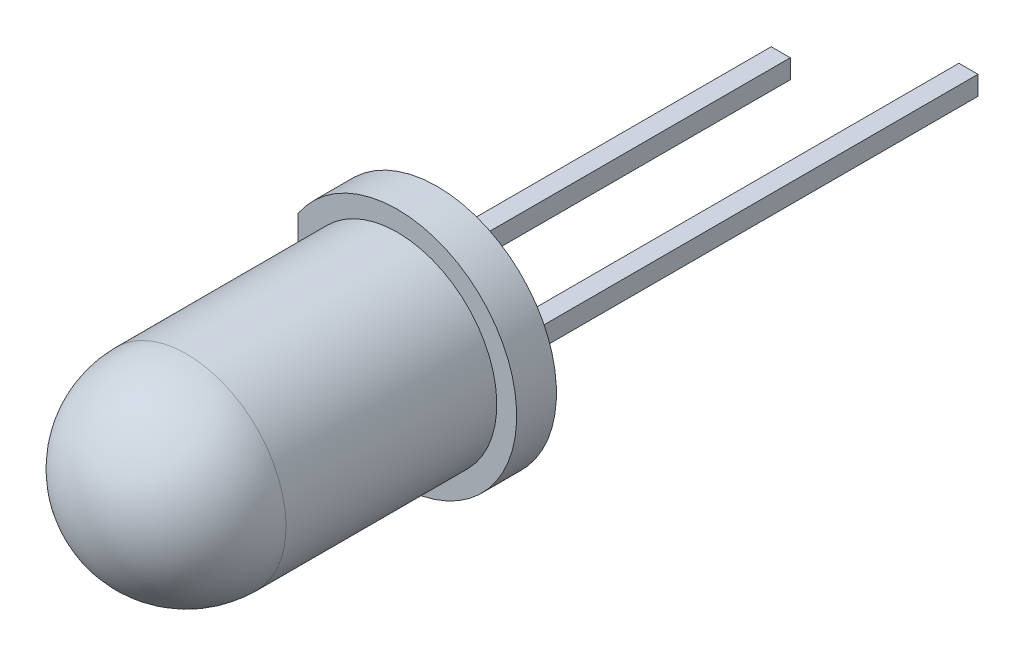
ISO-10303-21;
HEADER;
FILE_DESCRIPTION(('STEP AP214'),'2;1');
FILE_NAME('part.step','',(''),(''),'','','');
FILE_SCHEMA(('AUTOMOTIVE_DESIGN { 1 0 10303 214 1 1 1 1 }'));
ENDSEC;
DATA;
#1=APPLICATION_CONTEXT('core data for automotive mechanical design processes');
#2=APPLICATION_PROTOCOL_DEFINITION('international standard','automotive_design',2000,#1);
#3=PRODUCT_CONTEXT('',#1,'mechanical');
#4=PRODUCT('Part','Part','',(#3));
#5=PRODUCT_RELATED_PRODUCT_CATEGORY('part','',(#4));
#6=PRODUCT_DEFINITION_FORMATION('','',#4);
#7=PRODUCT_DEFINITION_CONTEXT('part definition',#1,'design');
#8=PRODUCT_DEFINITION('design','',#6,#7);
#9=PRODUCT_DEFINITION_SHAPE('','',#8);
#10=(LENGTH_UNIT() NAMED_UNIT(*) SI_UNIT(.MILLI.,.METRE.));
#11=(NAMED_UNIT(*) PLANE_ANGLE_UNIT() SI_UNIT($,.RADIAN.));
#12=(NAMED_UNIT(*) SI_UNIT($,.STERADIAN.) SOLID_ANGLE_UNIT());
#13=UNCERTAINTY_MEASURE_WITH_UNIT(LENGTH_MEASURE(1.E-05),#10,'distance_accuracy_value','');
#14=(GEOMETRIC_REPRESENTATION_CONTEXT(3) GLOBAL_UNCERTAINTY_ASSIGNED_CONTEXT((#13)) GLOBAL_UNIT_ASSIGNED_CONTEXT((#10,
#11,#12)) REPRESENTATION_CONTEXT('',''));
#15=CARTESIAN_POINT('',(0.,0.,0.));
#16=DIRECTION('',(0.,0.,1.));
#17=DIRECTION('',(1.,0.,0.));
#18=AXIS2_PLACEMENT_3D('',#15,#16,#17);
#19=CARTESIAN_POINT('',(-0.0499999999999997,0.,4.26666666666667));
#20=DIRECTION('',(0.,0.,1.));
#21=DIRECTION('',(-1.,0.,0.));
#22=AXIS2_PLACEMENT_3D('',#19,#20,#21);
#23=SPHERICAL_SURFACE('',#22,0.566666666666667);
#24=CARTESIAN_POINT('',(-0.0499999999999997,-0.24,4.26666666666667));
#25=DIRECTION('',(0.,1.,0.));
#26=DIRECTION('',(0.,0.,1.));
#27=AXIS2_PLACEMENT_3D('',#24,#25,#26);
#28=CIRCLE('',#27,0.513333333333333);
#29=CARTESIAN_POINT('',(-0.488634243989226,-0.24,4.));
#30=VERTEX_POINT('',#29);
#31=CARTESIAN_POINT('',(0.388634243989226,-0.24,4.));
#32=VERTEX_POINT('',#31);
#33=EDGE_CURVE('E162',#30,#32,#28,.F.);
#34=ORIENTED_EDGE('',*,*,#33,.T.);
#35=CARTESIAN_POINT('',(-0.0499999999999997,0.,4.));
#36=DIRECTION('',(0.,0.,1.));
#37=DIRECTION('',(1.,0.,0.));
#38=AXIS2_PLACEMENT_3D('',#35,#36,#37);
#39=CIRCLE('',#38,0.5);
#40=EDGE_CURVE('E57',#30,#32,#39,.T.);
#41=ORIENTED_EDGE('',*,*,#40,.F.);
#42=EDGE_LOOP('',(#34,#41));
#43=FACE_BOUND('',#42,.T.);
#44=ADVANCED_FACE('F49',(#43),#23,.T.);
#45=CARTESIAN_POINT('',(0.388634243989226,0.24,4.));
#46=VERTEX_POINT('',#45);
#47=CARTESIAN_POINT('',(-0.488634243989226,0.24,4.));
#48=VERTEX_POINT('',#47);
#49=EDGE_CURVE('E12',#46,#48,#39,.T.);
#50=ORIENTED_EDGE('',*,*,#49,.F.);
#51=CARTESIAN_POINT('',(-0.0499999999999997,0.24,4.26666666666667));
#52=DIRECTION('',(0.,1.,0.));
#53=DIRECTION('',(0.,0.,1.));
#54=AXIS2_PLACEMENT_3D('',#51,#52,#53);
#55=CIRCLE('',#54,0.513333333333333);
#56=EDGE_CURVE('E184',#48,#46,#55,.F.);
#57=ORIENTED_EDGE('',*,*,#56,.F.);
#58=EDGE_LOOP('',(#50,#57));
#59=FACE_BOUND('',#58,.T.);
#60=ADVANCED_FACE('F51',(#59),#23,.T.);
#61=CARTESIAN_POINT('',(-0.55,0.,4.));
#62=DIRECTION('',(0.,0.,-1.));
#63=DIRECTION('',(-1.,0.,0.));
#64=AXIS2_PLACEMENT_3D('',#61,#62,#63);
#65=PLANE('',#64);
#66=CARTESIAN_POINT('',(-0.0499999999999997,0.,4.));
#67=DIRECTION('',(0.,0.,1.));
#68=DIRECTION('',(1.,0.,0.));
#69=AXIS2_PLACEMENT_3D('',#66,#67,#68);
#70=CIRCLE('',#69,0.2);
#71=CARTESIAN_POINT('',(0.15,0.,4.));
#72=VERTEX_POINT('',#71);
#73=EDGE_CURVE('E257',#72,#72,#70,.T.);
#74=ORIENTED_EDGE('',*,*,#73,.F.);
#75=EDGE_LOOP('',(#74));
#76=FACE_BOUND('',#75,.T.);
#77=ORIENTED_EDGE('',*,*,#49,.T.);
#78=DIRECTION('',(1.,0.,0.));
#79=VECTOR('',#78,1.);
#80=CARTESIAN_POINT('',(-1.3,0.24,4.));
#81=LINE('',#80,#79);
#82=CARTESIAN_POINT('',(-1.3,0.24,4.));
#83=VERTEX_POINT('',#82);
#84=EDGE_CURVE('E103',#83,#48,#81,.T.);
#85=ORIENTED_EDGE('',*,*,#84,.F.);
#86=DIRECTION('',(0.,-1.,0.));
#87=VECTOR('',#86,1.);
#88=CARTESIAN_POINT('',(-1.3,0.24,4.));
#89=LINE('',#88,#87);
#90=CARTESIAN_POINT('',(-1.3,-0.24,4.));
#91=VERTEX_POINT('',#90);
#92=EDGE_CURVE('E161',#83,#91,#89,.T.);
#93=ORIENTED_EDGE('',*,*,#92,.T.);
#94=DIRECTION('',(1.,0.,0.));
#95=VECTOR('',#94,1.);
#96=CARTESIAN_POINT('',(-1.3,-0.24,4.));
#97=LINE('',#96,#95);
#98=EDGE_CURVE('E64',#91,#30,#97,.T.);
#99=ORIENTED_EDGE('',*,*,#98,.T.);
#100=ORIENTED_EDGE('',*,*,#40,.T.);
#101=CARTESIAN_POINT('',(1.2,-0.24,4.));
#102=VERTEX_POINT('',#101);
#103=EDGE_CURVE('E147',#32,#102,#97,.T.);
#104=ORIENTED_EDGE('',*,*,#103,.T.);
#105=DIRECTION('',(0.,-1.,0.));
#106=VECTOR('',#105,1.);
#107=CARTESIAN_POINT('',(1.2,0.24,4.));
#108=LINE('',#107,#106);
#109=CARTESIAN_POINT('',(1.2,0.24,4.));
#110=VERTEX_POINT('',#109);
#111=EDGE_CURVE('E131',#110,#102,#108,.T.);
#112=ORIENTED_EDGE('',*,*,#111,.F.);
#113=EDGE_CURVE('E119',#46,#110,#81,.T.);
#114=ORIENTED_EDGE('',*,*,#113,.F.);
#115=EDGE_LOOP('',(#77,#85,#93,#99,#100,#104,#112,#114));
#116=FACE_BOUND('',#115,.T.);
#117=ADVANCED_FACE('F167',(#76,#116),#65,.F.);
#118=CARTESIAN_POINT('',(0.,0.24,0.));
#119=DIRECTION('',(0.,1.,0.));
#120=DIRECTION('',(0.,0.,1.));
#121=AXIS2_PLACEMENT_3D('',#118,#119,#120);
#122=PLANE('',#121);
#123=ORIENTED_EDGE('',*,*,#84,.T.);
#124=ORIENTED_EDGE('',*,*,#56,.T.);
#125=ORIENTED_EDGE('',*,*,#113,.T.);
#126=DIRECTION('',(-0.508148861978286,0.,-0.861269257590315));
#127=VECTOR('',#126,1.);
#128=CARTESIAN_POINT('',(1.2,0.24,4.));
#129=LINE('',#128,#127);
#130=CARTESIAN_POINT('',(0.0199999999999998,0.24,2.));
#131=VERTEX_POINT('',#130);
#132=EDGE_CURVE('E110',#110,#131,#129,.T.);
#133=ORIENTED_EDGE('',*,*,#132,.T.);
#134=DIRECTION('',(-1.,0.,0.));
#135=VECTOR('',#134,1.);
#136=CARTESIAN_POINT('',(0.0199999999999998,0.24,2.));
#137=LINE('',#136,#135);
#138=CARTESIAN_POINT('',(-1.12,0.24,2.));
#139=VERTEX_POINT('',#138);
#140=EDGE_CURVE('E115',#131,#139,#137,.T.);
#141=ORIENTED_EDGE('',*,*,#140,.T.);
#142=DIRECTION('',(0.,0.,-1.));
#143=VECTOR('',#142,1.);
#144=CARTESIAN_POINT('',(-1.12,0.24,2.));
#145=LINE('',#144,#143);
#146=CARTESIAN_POINT('',(-1.12,0.24,-10.));
#147=VERTEX_POINT('',#146);
#148=EDGE_CURVE('E137',#139,#147,#145,.T.);
#149=ORIENTED_EDGE('',*,*,#148,.T.);
#150=DIRECTION('',(1.,0.,0.));
#151=VECTOR('',#150,1.);
#152=CARTESIAN_POINT('',(-1.12,0.24,-10.));
#153=LINE('',#152,#151);
#154=CARTESIAN_POINT('',(-1.6,0.24,-10.));
#155=VERTEX_POINT('',#154);
#156=EDGE_CURVE('E148',#155,#147,#153,.T.);
#157=ORIENTED_EDGE('',*,*,#156,.F.);
#158=DIRECTION('',(0.,0.,1.));
#159=VECTOR('',#158,1.);
#160=CARTESIAN_POINT('',(-1.6,0.24,0.));
#161=LINE('',#160,#159);
#162=CARTESIAN_POINT('',(-1.6,0.24,3.5));
#163=VERTEX_POINT('',#162);
#164=EDGE_CURVE('E73',#155,#163,#161,.T.);
#165=ORIENTED_EDGE('',*,*,#164,.T.);
#166=DIRECTION('',(0.514495755427526,0.,0.857492925712544));
#167=VECTOR('',#166,1.);
#168=CARTESIAN_POINT('',(-1.6,0.24,3.5));
#169=LINE('',#168,#167);
#170=EDGE_CURVE('E157',#163,#83,#169,.T.);
#171=ORIENTED_EDGE('',*,*,#170,.T.);
#172=EDGE_LOOP('',(#123,#124,#125,#133,#141,#149,#157,#165,#171));
#173=FACE_BOUND('',#172,.T.);
#174=ADVANCED_FACE('F112',(#173),#122,.T.);
#175=CARTESIAN_POINT('',(0.,-0.24,0.));
#176=DIRECTION('',(0.,1.,0.));
#177=DIRECTION('',(0.,0.,1.));
#178=AXIS2_PLACEMENT_3D('',#175,#176,#177);
#179=PLANE('',#178);
#180=ORIENTED_EDGE('',*,*,#33,.F.);
#181=ORIENTED_EDGE('',*,*,#98,.F.);
#182=DIRECTION('',(0.514495755427526,0.,0.857492925712544));
#183=VECTOR('',#182,1.);
#184=CARTESIAN_POINT('',(-1.6,-0.24,3.5));
#185=LINE('',#184,#183);
#186=CARTESIAN_POINT('',(-1.6,-0.24,3.5));
#187=VERTEX_POINT('',#186);
#188=EDGE_CURVE('E144',#187,#91,#185,.T.);
#189=ORIENTED_EDGE('',*,*,#188,.F.);
#190=DIRECTION('',(0.,0.,1.));
#191=VECTOR('',#190,1.);
#192=CARTESIAN_POINT('',(-1.6,-0.24,0.));
#193=LINE('',#192,#191);
#194=CARTESIAN_POINT('',(-1.6,-0.24,-10.));
#195=VERTEX_POINT('',#194);
#196=EDGE_CURVE('E97',#195,#187,#193,.T.);
#197=ORIENTED_EDGE('',*,*,#196,.F.);
#198=DIRECTION('',(-1.,0.,0.));
#199=VECTOR('',#198,1.);
#200=CARTESIAN_POINT('',(-1.12,-0.24,-10.));
#201=LINE('',#200,#199);
#202=CARTESIAN_POINT('',(-1.12,-0.24,-10.));
#203=VERTEX_POINT('',#202);
#204=EDGE_CURVE('E205',#203,#195,#201,.T.);
#205=ORIENTED_EDGE('',*,*,#204,.F.);
#206=DIRECTION('',(0.,0.,-1.));
#207=VECTOR('',#206,1.);
#208=CARTESIAN_POINT('',(-1.12,-0.24,2.));
#209=LINE('',#208,#207);
#210=CARTESIAN_POINT('',(-1.12,-0.24,2.));
#211=VERTEX_POINT('',#210);
#212=EDGE_CURVE('E153',#211,#203,#209,.T.);
#213=ORIENTED_EDGE('',*,*,#212,.F.);
#214=DIRECTION('',(-1.,0.,0.));
#215=VECTOR('',#214,1.);
#216=CARTESIAN_POINT('',(0.0199999999999998,-0.24,2.));
#217=LINE('',#216,#215);
#218=CARTESIAN_POINT('',(0.0199999999999998,-0.24,2.));
#219=VERTEX_POINT('',#218);
#220=EDGE_CURVE('E151',#219,#211,#217,.T.);
#221=ORIENTED_EDGE('',*,*,#220,.F.);
#222=DIRECTION('',(-0.508148861978286,0.,-0.861269257590315));
#223=VECTOR('',#222,1.);
#224=CARTESIAN_POINT('',(1.2,-0.24,4.));
#225=LINE('',#224,#223);
#226=EDGE_CURVE('E128',#102,#219,#225,.T.);
#227=ORIENTED_EDGE('',*,*,#226,.F.);
#228=ORIENTED_EDGE('',*,*,#103,.F.);
#229=EDGE_LOOP('',(#180,#181,#189,#197,#205,#213,#221,#227,#228));
#230=FACE_BOUND('',#229,.T.);
#231=ADVANCED_FACE('F219',(#230),#179,.F.);
#232=CARTESIAN_POINT('',(-1.6,0.24,3.5));
#233=DIRECTION('',(0.857492925712544,0.,-0.514495755427526));
#234=DIRECTION('',(-0.514495755427526,0.,-0.857492925712544));
#235=AXIS2_PLACEMENT_3D('',#232,#233,#234);
#236=PLANE('',#235);
#237=ORIENTED_EDGE('',*,*,#188,.T.);
#238=ORIENTED_EDGE('',*,*,#92,.F.);
#239=ORIENTED_EDGE('',*,*,#170,.F.);
#240=DIRECTION('',(0.,-1.,0.));
#241=VECTOR('',#240,1.);
#242=CARTESIAN_POINT('',(-1.6,0.24,3.5));
#243=LINE('',#242,#241);
#244=EDGE_CURVE('E143',#163,#187,#243,.T.);
#245=ORIENTED_EDGE('',*,*,#244,.T.);
#246=EDGE_LOOP('',(#237,#238,#239,#245));
#247=FACE_BOUND('',#246,.T.);
#248=ADVANCED_FACE('F216',(#247),#236,.F.);
#249=CARTESIAN_POINT('',(1.2,0.24,4.));
#250=DIRECTION('',(-0.861269257590315,0.,0.508148861978286));
#251=DIRECTION('',(0.508148861978286,0.,0.861269257590315));
#252=AXIS2_PLACEMENT_3D('',#249,#250,#251);
#253=PLANE('',#252);
#254=ORIENTED_EDGE('',*,*,#226,.T.);
#255=DIRECTION('',(0.,-1.,0.));
#256=VECTOR('',#255,1.);
#257=CARTESIAN_POINT('',(0.0199999999999998,0.24,2.));
#258=LINE('',#257,#256);
#259=EDGE_CURVE('E125',#131,#219,#258,.T.);
#260=ORIENTED_EDGE('',*,*,#259,.F.);
#261=ORIENTED_EDGE('',*,*,#132,.F.);
#262=ORIENTED_EDGE('',*,*,#111,.T.);
#263=EDGE_LOOP('',(#254,#260,#261,#262));
#264=FACE_BOUND('',#263,.T.);
#265=ADVANCED_FACE('F126',(#264),#253,.F.);
#266=CARTESIAN_POINT('',(0.0199999999999998,0.24,2.));
#267=DIRECTION('',(0.,0.,1.));
#268=DIRECTION('',(1.,0.,0.));
#269=AXIS2_PLACEMENT_3D('',#266,#267,#268);
#270=PLANE('',#269);
#271=ORIENTED_EDGE('',*,*,#220,.T.);
#272=DIRECTION('',(0.,-1.,0.));
#273=VECTOR('',#272,1.);
#274=CARTESIAN_POINT('',(-1.12,0.24,2.));
#275=LINE('',#274,#273);
#276=EDGE_CURVE('E132',#139,#211,#275,.T.);
#277=ORIENTED_EDGE('',*,*,#276,.F.);
#278=ORIENTED_EDGE('',*,*,#140,.F.);
#279=ORIENTED_EDGE('',*,*,#259,.T.);
#280=EDGE_LOOP('',(#271,#277,#278,#279));
#281=FACE_BOUND('',#280,.T.);
#282=ADVANCED_FACE('F134',(#281),#270,.F.);
#283=CARTESIAN_POINT('',(-1.12,0.24,2.));
#284=DIRECTION('',(-1.,0.,0.));
#285=DIRECTION('',(0.,0.,1.));
#286=AXIS2_PLACEMENT_3D('',#283,#284,#285);
#287=PLANE('',#286);
#288=ORIENTED_EDGE('',*,*,#212,.T.);
#289=DIRECTION('',(0.,-1.,0.));
#290=VECTOR('',#289,1.);
#291=CARTESIAN_POINT('',(-1.12,-0.24,-10.));
#292=LINE('',#291,#290);
#293=EDGE_CURVE('E199',#147,#203,#292,.T.);
#294=ORIENTED_EDGE('',*,*,#293,.F.);
#295=ORIENTED_EDGE('',*,*,#148,.F.);
#296=ORIENTED_EDGE('',*,*,#276,.T.);
#297=EDGE_LOOP('',(#288,#294,#295,#296));
#298=FACE_BOUND('',#297,.T.);
#299=ADVANCED_FACE('F202',(#298),#287,.F.);
#300=CARTESIAN_POINT('',(-1.6,0.24,0.));
#301=DIRECTION('',(1.,0.,0.));
#302=DIRECTION('',(0.,0.,-1.));
#303=AXIS2_PLACEMENT_3D('',#300,#301,#302);
#304=PLANE('',#303);
#305=ORIENTED_EDGE('',*,*,#196,.T.);
#306=ORIENTED_EDGE('',*,*,#244,.F.);
#307=ORIENTED_EDGE('',*,*,#164,.F.);
#308=DIRECTION('',(0.,1.,0.));
#309=VECTOR('',#308,1.);
#310=CARTESIAN_POINT('',(-1.6,-0.24,-10.));
#311=LINE('',#310,#309);
#312=EDGE_CURVE('E200',#195,#155,#311,.T.);
#313=ORIENTED_EDGE('',*,*,#312,.F.);
#314=EDGE_LOOP('',(#305,#306,#307,#313));
#315=FACE_BOUND('',#314,.T.);
#316=ADVANCED_FACE('F220',(#315),#304,.F.);
#317=CARTESIAN_POINT('',(0.,0.,-10.));
#318=DIRECTION('',(0.,0.,1.));
#319=DIRECTION('',(1.,0.,0.));
#320=AXIS2_PLACEMENT_3D('',#317,#318,#319);
#321=PLANE('',#320);
#322=ORIENTED_EDGE('',*,*,#293,.T.);
#323=ORIENTED_EDGE('',*,*,#204,.T.);
#324=ORIENTED_EDGE('',*,*,#312,.T.);
#325=ORIENTED_EDGE('',*,*,#156,.T.);
#326=EDGE_LOOP('',(#322,#323,#324,#325));
#327=FACE_BOUND('',#326,.T.);
#328=ADVANCED_FACE('F197',(#327),#321,.F.);
#329=CARTESIAN_POINT('',(-0.0499999999999997,0.,3.9));
#330=DIRECTION('',(0.,0.,1.));
#331=DIRECTION('',(1.,0.,0.));
#332=AXIS2_PLACEMENT_3D('',#329,#330,#331);
#333=CYLINDRICAL_SURFACE('',#332,0.2);
#334=CARTESIAN_POINT('',(-0.0499999999999997,0.,3.9));
#335=DIRECTION('',(0.,0.,1.));
#336=DIRECTION('',(1.,0.,0.));
#337=AXIS2_PLACEMENT_3D('',#334,#335,#336);
#338=CIRCLE('',#337,0.2);
#339=CARTESIAN_POINT('',(0.15,0.,3.9));
#340=VERTEX_POINT('',#339);
#341=EDGE_CURVE('E208',#340,#340,#338,.T.);
#342=ORIENTED_EDGE('',*,*,#341,.F.);
#343=EDGE_LOOP('',(#342));
#344=FACE_BOUND('',#343,.T.);
#345=ORIENTED_EDGE('',*,*,#73,.T.);
#346=EDGE_LOOP('',(#345));
#347=FACE_BOUND('',#346,.T.);
#348=ADVANCED_FACE('F227',(#344,#347),#333,.F.);
#349=CARTESIAN_POINT('',(-0.0499999999999997,0.,3.9));
#350=DIRECTION('',(0.,0.,1.));
#351=DIRECTION('',(1.,0.,0.));
#352=AXIS2_PLACEMENT_3D('',#349,#350,#351);
#353=PLANE('',#352);
#354=ORIENTED_EDGE('',*,*,#341,.T.);
#355=EDGE_LOOP('',(#354));
#356=FACE_BOUND('',#355,.T.);
#357=ADVANCED_FACE('F249',(#356),#353,.T.);
#358=CLOSED_SHELL('',(#44,#60,#117,#174,#231,#248,#265,#282,#299,#316,#328,#348,#357));
#359=MANIFOLD_SOLID_BREP('B2',#358);
#360=CARTESIAN_POINT('',(1.12,0.24,2.));
#361=DIRECTION('',(0.,0.,1.));
#362=DIRECTION('',(1.,0.,0.));
#363=AXIS2_PLACEMENT_3D('',#360,#361,#362);
#364=PLANE('',#363);
#365=DIRECTION('',(-1.,0.,0.));
#366=VECTOR('',#365,1.);
#367=CARTESIAN_POINT('',(1.12,-0.24,2.));
#368=LINE('',#367,#366);
#369=CARTESIAN_POINT('',(1.12,-0.24,2.));
#370=VERTEX_POINT('',#369);
#371=CARTESIAN_POINT('',(0.22,-0.24,2.));
#372=VERTEX_POINT('',#371);
#373=EDGE_CURVE('E454',#370,#372,#368,.T.);
#374=ORIENTED_EDGE('',*,*,#373,.T.);
#375=DIRECTION('',(0.,-1.,0.));
#376=VECTOR('',#375,1.);
#377=CARTESIAN_POINT('',(0.22,0.24,2.));
#378=LINE('',#377,#376);
#379=CARTESIAN_POINT('',(0.22,0.24,2.));
#380=VERTEX_POINT('',#379);
#381=EDGE_CURVE('E47',#380,#372,#378,.T.);
#382=ORIENTED_EDGE('',*,*,#381,.F.);
#383=DIRECTION('',(-1.,0.,0.));
#384=VECTOR('',#383,1.);
#385=CARTESIAN_POINT('',(1.12,0.24,2.));
#386=LINE('',#385,#384);
#387=CARTESIAN_POINT('',(1.12,0.24,2.));
#388=VERTEX_POINT('',#387);
#389=EDGE_CURVE('E455',#388,#380,#386,.T.);
#390=ORIENTED_EDGE('',*,*,#389,.F.);
#391=DIRECTION('',(0.,-1.,0.));
#392=VECTOR('',#391,1.);
#393=CARTESIAN_POINT('',(1.12,0.24,2.));
#394=LINE('',#393,#392);
#395=EDGE_CURVE('E460',#388,#370,#394,.T.);
#396=ORIENTED_EDGE('',*,*,#395,.T.);
#397=EDGE_LOOP('',(#374,#382,#390,#396));
#398=FACE_BOUND('',#397,.T.);
#399=ADVANCED_FACE('F368',(#398),#364,.F.);
#400=CARTESIAN_POINT('',(0.22,0.24,2.));
#401=DIRECTION('',(0.861269257590315,0.,-0.508148861978286));
#402=DIRECTION('',(-0.508148861978286,0.,-0.861269257590315));
#403=AXIS2_PLACEMENT_3D('',#400,#401,#402);
#404=PLANE('',#403);
#405=DIRECTION('',(0.508148861978286,0.,0.861269257590315));
#406=VECTOR('',#405,1.);
#407=CARTESIAN_POINT('',(0.22,-0.24,2.));
#408=LINE('',#407,#406);
#409=CARTESIAN_POINT('',(1.4,-0.24,4.));
#410=VERTEX_POINT('',#409);
#411=EDGE_CURVE('E463',#372,#410,#408,.T.);
#412=ORIENTED_EDGE('',*,*,#411,.T.);
#413=DIRECTION('',(0.,-1.,0.));
#414=VECTOR('',#413,1.);
#415=CARTESIAN_POINT('',(1.4,0.24,4.));
#416=LINE('',#415,#414);
#417=CARTESIAN_POINT('',(1.4,0.24,4.));
#418=VERTEX_POINT('',#417);
#419=EDGE_CURVE('E376',#418,#410,#416,.T.);
#420=ORIENTED_EDGE('',*,*,#419,.F.);
#421=DIRECTION('',(0.508148861978286,0.,0.861269257590315));
#422=VECTOR('',#421,1.);
#423=CARTESIAN_POINT('',(0.22,0.24,2.));
#424=LINE('',#423,#422);
#425=EDGE_CURVE('E417',#380,#418,#424,.T.);
#426=ORIENTED_EDGE('',*,*,#425,.F.);
#427=ORIENTED_EDGE('',*,*,#381,.T.);
#428=EDGE_LOOP('',(#412,#420,#426,#427));
#429=FACE_BOUND('',#428,.T.);
#430=ADVANCED_FACE('F478',(#429),#404,.F.);
#431=CARTESIAN_POINT('',(1.4,0.24,4.));
#432=DIRECTION('',(0.,0.,-1.));
#433=DIRECTION('',(-1.,0.,0.));
#434=AXIS2_PLACEMENT_3D('',#431,#432,#433);
#435=PLANE('',#434);
#436=DIRECTION('',(1.,0.,0.));
#437=VECTOR('',#436,1.);
#438=CARTESIAN_POINT('',(1.4,-0.24,4.));
#439=LINE('',#438,#437);
#440=CARTESIAN_POINT('',(1.6,-0.24,4.));
#441=VERTEX_POINT('',#440);
#442=EDGE_CURVE('E403',#410,#441,#439,.T.);
#443=ORIENTED_EDGE('',*,*,#442,.T.);
#444=DIRECTION('',(0.,-1.,0.));
#445=VECTOR('',#444,1.);
#446=CARTESIAN_POINT('',(1.6,0.24,4.));
#447=LINE('',#446,#445);
#448=CARTESIAN_POINT('',(1.6,0.24,4.));
#449=VERTEX_POINT('',#448);
#450=EDGE_CURVE('E469',#449,#441,#447,.T.);
#451=ORIENTED_EDGE('',*,*,#450,.F.);
#452=DIRECTION('',(1.,0.,0.));
#453=VECTOR('',#452,1.);
#454=CARTESIAN_POINT('',(1.4,0.24,4.));
#455=LINE('',#454,#453);
#456=EDGE_CURVE('E434',#418,#449,#455,.T.);
#457=ORIENTED_EDGE('',*,*,#456,.F.);
#458=ORIENTED_EDGE('',*,*,#419,.T.);
#459=EDGE_LOOP('',(#443,#451,#457,#458));
#460=FACE_BOUND('',#459,.T.);
#461=ADVANCED_FACE('F470',(#460),#435,.F.);
#462=CARTESIAN_POINT('',(1.6,0.24,4.));
#463=DIRECTION('',(-1.,0.,0.));
#464=DIRECTION('',(0.,0.,1.));
#465=AXIS2_PLACEMENT_3D('',#462,#463,#464);
#466=PLANE('',#465);
#467=DIRECTION('',(0.,0.,-1.));
#468=VECTOR('',#467,1.);
#469=CARTESIAN_POINT('',(1.6,-0.24,4.));
#470=LINE('',#469,#468);
#471=CARTESIAN_POINT('',(1.6,-0.24,-12.));
#472=VERTEX_POINT('',#471);
#473=EDGE_CURVE('E441',#441,#472,#470,.T.);
#474=ORIENTED_EDGE('',*,*,#473,.T.);
#475=DIRECTION('',(0.,-1.,0.));
#476=VECTOR('',#475,1.);
#477=CARTESIAN_POINT('',(1.6,0.24,-12.));
#478=LINE('',#477,#476);
#479=CARTESIAN_POINT('',(1.6,0.24,-12.));
#480=VERTEX_POINT('',#479);
#481=EDGE_CURVE('E438',#480,#472,#478,.T.);
#482=ORIENTED_EDGE('',*,*,#481,.F.);
#483=DIRECTION('',(0.,0.,-1.));
#484=VECTOR('',#483,1.);
#485=CARTESIAN_POINT('',(1.6,0.24,4.));
#486=LINE('',#485,#484);
#487=EDGE_CURVE('E428',#449,#480,#486,.T.);
#488=ORIENTED_EDGE('',*,*,#487,.F.);
#489=ORIENTED_EDGE('',*,*,#450,.T.);
#490=EDGE_LOOP('',(#474,#482,#488,#489));
#491=FACE_BOUND('',#490,.T.);
#492=ADVANCED_FACE('F439',(#491),#466,.F.);
#493=CARTESIAN_POINT('',(1.12,0.24,0.));
#494=DIRECTION('',(1.,0.,0.));
#495=DIRECTION('',(0.,0.,-1.));
#496=AXIS2_PLACEMENT_3D('',#493,#494,#495);
#497=PLANE('',#496);
#498=DIRECTION('',(0.,0.,1.));
#499=VECTOR('',#498,1.);
#500=CARTESIAN_POINT('',(1.12,-0.24,0.));
#501=LINE('',#500,#499);
#502=CARTESIAN_POINT('',(1.12,-0.24,-12.));
#503=VERTEX_POINT('',#502);
#504=EDGE_CURVE('E410',#503,#370,#501,.T.);
#505=ORIENTED_EDGE('',*,*,#504,.T.);
#506=ORIENTED_EDGE('',*,*,#395,.F.);
#507=DIRECTION('',(0.,0.,1.));
#508=VECTOR('',#507,1.);
#509=CARTESIAN_POINT('',(1.12,0.24,0.));
#510=LINE('',#509,#508);
#511=CARTESIAN_POINT('',(1.12,0.24,-12.));
#512=VERTEX_POINT('',#511);
#513=EDGE_CURVE('E384',#512,#388,#510,.T.);
#514=ORIENTED_EDGE('',*,*,#513,.F.);
#515=DIRECTION('',(0.,1.,0.));
#516=VECTOR('',#515,1.);
#517=CARTESIAN_POINT('',(1.12,-0.24,-12.));
#518=LINE('',#517,#516);
#519=EDGE_CURVE('E449',#503,#512,#518,.T.);
#520=ORIENTED_EDGE('',*,*,#519,.F.);
#521=EDGE_LOOP('',(#505,#506,#514,#520));
#522=FACE_BOUND('',#521,.T.);
#523=ADVANCED_FACE('F474',(#522),#497,.F.);
#524=CARTESIAN_POINT('',(0.,0.24,0.));
#525=DIRECTION('',(0.,-1.,0.));
#526=DIRECTION('',(0.,0.,-1.));
#527=AXIS2_PLACEMENT_3D('',#524,#525,#526);
#528=PLANE('',#527);
#529=ORIENTED_EDGE('',*,*,#389,.T.);
#530=ORIENTED_EDGE('',*,*,#425,.T.);
#531=ORIENTED_EDGE('',*,*,#456,.T.);
#532=ORIENTED_EDGE('',*,*,#487,.T.);
#533=DIRECTION('',(1.,0.,0.));
#534=VECTOR('',#533,1.);
#535=CARTESIAN_POINT('',(1.12,0.24,-12.));
#536=LINE('',#535,#534);
#537=EDGE_CURVE('E432',#512,#480,#536,.T.);
#538=ORIENTED_EDGE('',*,*,#537,.F.);
#539=ORIENTED_EDGE('',*,*,#513,.T.);
#540=EDGE_LOOP('',(#529,#530,#531,#532,#538,#539));
#541=FACE_BOUND('',#540,.T.);
#542=ADVANCED_FACE('F430',(#541),#528,.F.);
#543=CARTESIAN_POINT('',(0.,-0.24,0.));
#544=DIRECTION('',(0.,-1.,0.));
#545=DIRECTION('',(0.,0.,-1.));
#546=AXIS2_PLACEMENT_3D('',#543,#544,#545);
#547=PLANE('',#546);
#548=ORIENTED_EDGE('',*,*,#373,.F.);
#549=ORIENTED_EDGE('',*,*,#504,.F.);
#550=DIRECTION('',(-1.,0.,0.));
#551=VECTOR('',#550,1.);
#552=CARTESIAN_POINT('',(1.6,-0.24,-12.));
#553=LINE('',#552,#551);
#554=EDGE_CURVE('E445',#472,#503,#553,.T.);
#555=ORIENTED_EDGE('',*,*,#554,.F.);
#556=ORIENTED_EDGE('',*,*,#473,.F.);
#557=ORIENTED_EDGE('',*,*,#442,.F.);
#558=ORIENTED_EDGE('',*,*,#411,.F.);
#559=EDGE_LOOP('',(#548,#549,#555,#556,#557,#558));
#560=FACE_BOUND('',#559,.T.);
#561=ADVANCED_FACE('F473',(#560),#547,.T.);
#562=CARTESIAN_POINT('',(0.,0.,-12.));
#563=DIRECTION('',(0.,0.,-1.));
#564=DIRECTION('',(-1.,0.,0.));
#565=AXIS2_PLACEMENT_3D('',#562,#563,#564);
#566=PLANE('',#565);
#567=ORIENTED_EDGE('',*,*,#537,.T.);
#568=ORIENTED_EDGE('',*,*,#481,.T.);
#569=ORIENTED_EDGE('',*,*,#554,.T.);
#570=ORIENTED_EDGE('',*,*,#519,.T.);
#571=EDGE_LOOP('',(#567,#568,#569,#570));
#572=FACE_BOUND('',#571,.T.);
#573=ADVANCED_FACE('F448',(#572),#566,.T.);
#574=CLOSED_SHELL('',(#399,#430,#461,#492,#523,#542,#561,#573));
#575=MANIFOLD_SOLID_BREP('B6',#574);
#576=CARTESIAN_POINT('',(0.,0.,1.));
#577=DIRECTION('',(0.,0.,-1.));
#578=DIRECTION('',(-1.,0.,0.));
#579=AXIS2_PLACEMENT_3D('',#576,#577,#578);
#580=CYLINDRICAL_SURFACE('',#579,3.);
#581=CARTESIAN_POINT('',(0.,0.,1.));
#582=DIRECTION('',(0.,0.,1.));
#583=DIRECTION('',(1.,0.,0.));
#584=AXIS2_PLACEMENT_3D('',#581,#582,#583);
#585=CIRCLE('',#584,3.);
#586=CARTESIAN_POINT('',(-2.5,-1.6583123951777,1.));
#587=VERTEX_POINT('',#586);
#588=CARTESIAN_POINT('',(-2.5,1.6583123951777,1.));
#589=VERTEX_POINT('',#588);
#590=EDGE_CURVE('E579',#587,#589,#585,.T.);
#591=ORIENTED_EDGE('',*,*,#590,.F.);
#592=DIRECTION('',(0.,0.,-1.));
#593=VECTOR('',#592,1.);
#594=CARTESIAN_POINT('',(-2.5,-1.6583123951777,4.35410196624969));
#595=LINE('',#594,#593);
#596=CARTESIAN_POINT('',(-2.5,-1.6583123951777,0.));
#597=VERTEX_POINT('',#596);
#598=EDGE_CURVE('E777',#587,#597,#595,.T.);
#599=ORIENTED_EDGE('',*,*,#598,.T.);
#600=CARTESIAN_POINT('',(0.,0.,0.));
#601=DIRECTION('',(0.,0.,1.));
#602=DIRECTION('',(1.,0.,0.));
#603=AXIS2_PLACEMENT_3D('',#600,#601,#602);
#604=CIRCLE('',#603,3.);
#605=CARTESIAN_POINT('',(-2.5,1.6583123951777,0.));
#606=VERTEX_POINT('',#605);
#607=EDGE_CURVE('E785',#597,#606,#604,.T.);
#608=ORIENTED_EDGE('',*,*,#607,.T.);
#609=DIRECTION('',(0.,0.,-1.));
#610=VECTOR('',#609,1.);
#611=CARTESIAN_POINT('',(-2.5,1.6583123951777,4.35410196624969));
#612=LINE('',#611,#610);
#613=EDGE_CURVE('E780',#589,#606,#612,.T.);
#614=ORIENTED_EDGE('',*,*,#613,.F.);
#615=EDGE_LOOP('',(#591,#599,#608,#614));
#616=FACE_BOUND('',#615,.T.);
#617=ADVANCED_FACE('F572',(#616),#580,.T.);
#618=CARTESIAN_POINT('',(0.,0.,1.));
#619=DIRECTION('',(0.,0.,1.));
#620=DIRECTION('',(1.,0.,0.));
#621=AXIS2_PLACEMENT_3D('',#618,#619,#620);
#622=PLANE('',#621);
#623=DIRECTION('',(0.,-1.,0.));
#624=VECTOR('',#623,1.);
#625=CARTESIAN_POINT('',(-2.5,1.6583123951777,1.));
#626=LINE('',#625,#624);
#627=CARTESIAN_POINT('',(-2.5,0.,1.));
#628=VERTEX_POINT('',#627);
#629=EDGE_CURVE('E773',#628,#587,#626,.T.);
#630=ORIENTED_EDGE('',*,*,#629,.T.);
#631=ORIENTED_EDGE('',*,*,#590,.T.);
#632=EDGE_CURVE('E774',#589,#628,#626,.T.);
#633=ORIENTED_EDGE('',*,*,#632,.T.);
#634=CARTESIAN_POINT('',(0.,0.,1.));
#635=DIRECTION('',(0.,0.,1.));
#636=DIRECTION('',(1.,0.,0.));
#637=AXIS2_PLACEMENT_3D('',#634,#635,#636);
#638=CIRCLE('',#637,2.5);
#639=EDGE_CURVE('E366',#628,#628,#638,.T.);
#640=ORIENTED_EDGE('',*,*,#639,.F.);
#641=EDGE_LOOP('',(#630,#631,#633,#640));
#642=FACE_BOUND('',#641,.T.);
#643=ADVANCED_FACE('F799',(#642),#622,.T.);
#644=CARTESIAN_POINT('',(0.,0.,0.));
#645=DIRECTION('',(0.,0.,1.));
#646=DIRECTION('',(1.,0.,0.));
#647=AXIS2_PLACEMENT_3D('',#644,#645,#646);
#648=PLANE('',#647);
#649=DIRECTION('',(0.,1.,0.));
#650=VECTOR('',#649,1.);
#651=CARTESIAN_POINT('',(1.12,-0.24,0.));
#652=LINE('',#651,#650);
#653=CARTESIAN_POINT('',(1.12,-0.24,0.));
#654=VERTEX_POINT('',#653);
#655=CARTESIAN_POINT('',(1.12,0.24,0.));
#656=VERTEX_POINT('',#655);
#657=EDGE_CURVE('E686',#654,#656,#652,.T.);
#658=ORIENTED_EDGE('',*,*,#657,.F.);
#659=DIRECTION('',(-1.,0.,0.));
#660=VECTOR('',#659,1.);
#661=CARTESIAN_POINT('',(1.12,-0.24,0.));
#662=LINE('',#661,#660);
#663=CARTESIAN_POINT('',(1.6,-0.24,0.));
#664=VERTEX_POINT('',#663);
#665=EDGE_CURVE('E693',#664,#654,#662,.T.);
#666=ORIENTED_EDGE('',*,*,#665,.F.);
#667=DIRECTION('',(0.,1.,0.));
#668=VECTOR('',#667,1.);
#669=CARTESIAN_POINT('',(1.6,-0.24,0.));
#670=LINE('',#669,#668);
#671=CARTESIAN_POINT('',(1.6,0.24,0.));
#672=VERTEX_POINT('',#671);
#673=EDGE_CURVE('E741',#664,#672,#670,.T.);
#674=ORIENTED_EDGE('',*,*,#673,.T.);
#675=DIRECTION('',(-1.,0.,0.));
#676=VECTOR('',#675,1.);
#677=CARTESIAN_POINT('',(1.12,0.24,0.));
#678=LINE('',#677,#676);
#679=EDGE_CURVE('E707',#672,#656,#678,.T.);
#680=ORIENTED_EDGE('',*,*,#679,.T.);
#681=EDGE_LOOP('',(#658,#666,#674,#680));
#682=FACE_BOUND('',#681,.T.);
#683=DIRECTION('',(0.,1.,0.));
#684=VECTOR('',#683,1.);
#685=CARTESIAN_POINT('',(-1.6,-0.24,0.));
#686=LINE('',#685,#684);
#687=CARTESIAN_POINT('',(-1.6,-0.24,0.));
#688=VERTEX_POINT('',#687);
#689=CARTESIAN_POINT('',(-1.6,0.24,0.));
#690=VERTEX_POINT('',#689);
#691=EDGE_CURVE('E737',#688,#690,#686,.T.);
#692=ORIENTED_EDGE('',*,*,#691,.F.);
#693=DIRECTION('',(-1.,0.,0.));
#694=VECTOR('',#693,1.);
#695=CARTESIAN_POINT('',(-1.6,-0.24,0.));
#696=LINE('',#695,#694);
#697=CARTESIAN_POINT('',(-1.12,-0.24,0.));
#698=VERTEX_POINT('',#697);
#699=EDGE_CURVE('E715',#698,#688,#696,.T.);
#700=ORIENTED_EDGE('',*,*,#699,.F.);
#701=DIRECTION('',(0.,1.,0.));
#702=VECTOR('',#701,1.);
#703=CARTESIAN_POINT('',(-1.12,-0.24,0.));
#704=LINE('',#703,#702);
#705=CARTESIAN_POINT('',(-1.12,0.24,0.));
#706=VERTEX_POINT('',#705);
#707=EDGE_CURVE('E757',#698,#706,#704,.T.);
#708=ORIENTED_EDGE('',*,*,#707,.T.);
#709=DIRECTION('',(-1.,0.,0.));
#710=VECTOR('',#709,1.);
#711=CARTESIAN_POINT('',(-1.6,0.24,0.));
#712=LINE('',#711,#710);
#713=EDGE_CURVE('E738',#706,#690,#712,.T.);
#714=ORIENTED_EDGE('',*,*,#713,.T.);
#715=EDGE_LOOP('',(#692,#700,#708,#714));
#716=FACE_BOUND('',#715,.T.);
#717=ORIENTED_EDGE('',*,*,#607,.F.);
#718=DIRECTION('',(0.,-1.,0.));
#719=VECTOR('',#718,1.);
#720=CARTESIAN_POINT('',(-2.5,1.6583123951777,0.));
#721=LINE('',#720,#719);
#722=EDGE_CURVE('E760',#606,#597,#721,.T.);
#723=ORIENTED_EDGE('',*,*,#722,.F.);
#724=EDGE_LOOP('',(#717,#723));
#725=FACE_BOUND('',#724,.T.);
#726=ADVANCED_FACE('F705',(#682,#716,#725),#648,.F.);
#727=CARTESIAN_POINT('',(0.,0.,6.3));
#728=DIRECTION('',(0.,0.,-1.));
#729=DIRECTION('',(0.,1.,0.));
#730=AXIS2_PLACEMENT_3D('',#727,#728,#729);
#731=SPHERICAL_SURFACE('',#730,2.5);
#732=CARTESIAN_POINT('',(0.,0.,6.3));
#733=DIRECTION('',(0.,0.,-1.));
#734=DIRECTION('',(0.,1.,0.));
#735=AXIS2_PLACEMENT_3D('',#732,#733,#734);
#736=CIRCLE('',#735,2.5);
#737=CARTESIAN_POINT('',(0.,2.5,6.3));
#738=VERTEX_POINT('',#737);
#739=EDGE_CURVE('E782',#738,#738,#736,.T.);
#740=ORIENTED_EDGE('',*,*,#739,.F.);
#741=EDGE_LOOP('',(#740));
#742=FACE_BOUND('',#741,.T.);
#743=ADVANCED_FACE('F803',(#742),#731,.T.);
#744=CARTESIAN_POINT('',(0.,0.,1.));
#745=DIRECTION('',(0.,0.,-1.));
#746=DIRECTION('',(0.,1.,0.));
#747=AXIS2_PLACEMENT_3D('',#744,#745,#746);
#748=CYLINDRICAL_SURFACE('',#747,2.5);
#749=ORIENTED_EDGE('',*,*,#739,.T.);
#750=EDGE_LOOP('',(#749));
#751=FACE_BOUND('',#750,.T.);
#752=ORIENTED_EDGE('',*,*,#639,.T.);
#753=EDGE_LOOP('',(#752));
#754=FACE_BOUND('',#753,.T.);
#755=ADVANCED_FACE('F801',(#751,#754),#748,.T.);
#756=CARTESIAN_POINT('',(-2.5,1.6583123951777,4.35410196624969));
#757=DIRECTION('',(1.,0.,0.));
#758=DIRECTION('',(0.,0.,-1.));
#759=AXIS2_PLACEMENT_3D('',#756,#757,#758);
#760=PLANE('',#759);
#761=ORIENTED_EDGE('',*,*,#613,.T.);
#762=ORIENTED_EDGE('',*,*,#722,.T.);
#763=ORIENTED_EDGE('',*,*,#598,.F.);
#764=ORIENTED_EDGE('',*,*,#629,.F.);
#765=ORIENTED_EDGE('',*,*,#632,.F.);
#766=EDGE_LOOP('',(#761,#762,#763,#764,#765));
#767=FACE_BOUND('',#766,.T.);
#768=ADVANCED_FACE('F795',(#767),#760,.F.);
#769=CARTESIAN_POINT('',(-1.12,-0.24,0.));
#770=DIRECTION('',(1.,0.,0.));
#771=DIRECTION('',(0.,0.,-1.));
#772=AXIS2_PLACEMENT_3D('',#769,#770,#771);
#773=PLANE('',#772);
#774=DIRECTION('',(0.,0.,-1.));
#775=VECTOR('',#774,1.);
#776=CARTESIAN_POINT('',(-1.12,0.24,0.));
#777=LINE('',#776,#775);
#778=CARTESIAN_POINT('',(-1.12,0.24,2.));
#779=VERTEX_POINT('',#778);
#780=EDGE_CURVE('E719',#779,#706,#777,.T.);
#781=ORIENTED_EDGE('',*,*,#780,.T.);
#782=ORIENTED_EDGE('',*,*,#707,.F.);
#783=DIRECTION('',(0.,0.,-1.));
#784=VECTOR('',#783,1.);
#785=CARTESIAN_POINT('',(-1.12,-0.24,0.));
#786=LINE('',#785,#784);
#787=CARTESIAN_POINT('',(-1.12,-0.24,2.));
#788=VERTEX_POINT('',#787);
#789=EDGE_CURVE('E734',#788,#698,#786,.T.);
#790=ORIENTED_EDGE('',*,*,#789,.F.);
#791=DIRECTION('',(0.,1.,0.));
#792=VECTOR('',#791,1.);
#793=CARTESIAN_POINT('',(-1.12,-0.24,2.));
#794=LINE('',#793,#792);
#795=EDGE_CURVE('E761',#788,#779,#794,.T.);
#796=ORIENTED_EDGE('',*,*,#795,.T.);
#797=EDGE_LOOP('',(#781,#782,#790,#796));
#798=FACE_BOUND('',#797,.T.);
#799=ADVANCED_FACE('F810',(#798),#773,.F.);
#800=CARTESIAN_POINT('',(-1.12,-0.24,2.));
#801=DIRECTION('',(0.,0.,-1.));
#802=DIRECTION('',(-1.,0.,0.));
#803=AXIS2_PLACEMENT_3D('',#800,#801,#802);
#804=PLANE('',#803);
#805=DIRECTION('',(-1.,0.,0.));
#806=VECTOR('',#805,1.);
#807=CARTESIAN_POINT('',(-1.12,0.24,2.));
#808=LINE('',#807,#806);
#809=CARTESIAN_POINT('',(0.0199999999999998,0.24,2.));
#810=VERTEX_POINT('',#809);
#811=EDGE_CURVE('E752',#810,#779,#808,.T.);
#812=ORIENTED_EDGE('',*,*,#811,.T.);
#813=ORIENTED_EDGE('',*,*,#795,.F.);
#814=DIRECTION('',(-1.,0.,0.));
#815=VECTOR('',#814,1.);
#816=CARTESIAN_POINT('',(-1.12,-0.24,2.));
#817=LINE('',#816,#815);
#818=CARTESIAN_POINT('',(0.0199999999999998,-0.24,2.));
#819=VERTEX_POINT('',#818);
#820=EDGE_CURVE('E731',#819,#788,#817,.T.);
#821=ORIENTED_EDGE('',*,*,#820,.F.);
#822=DIRECTION('',(0.,1.,0.));
#823=VECTOR('',#822,1.);
#824=CARTESIAN_POINT('',(0.0199999999999998,-0.24,2.));
#825=LINE('',#824,#823);
#826=EDGE_CURVE('E763',#819,#810,#825,.T.);
#827=ORIENTED_EDGE('',*,*,#826,.T.);
#828=EDGE_LOOP('',(#812,#813,#821,#827));
#829=FACE_BOUND('',#828,.T.);
#830=ADVANCED_FACE('F855',(#829),#804,.F.);
#831=CARTESIAN_POINT('',(0.0199999999999998,-0.24,2.));
#832=DIRECTION('',(0.861269257590315,0.,-0.508148861978286));
#833=DIRECTION('',(-0.508148861978286,0.,-0.861269257590315));
#834=AXIS2_PLACEMENT_3D('',#831,#832,#833);
#835=PLANE('',#834);
#836=DIRECTION('',(-0.508148861978286,0.,-0.861269257590315));
#837=VECTOR('',#836,1.);
#838=CARTESIAN_POINT('',(0.0199999999999998,0.24,2.));
#839=LINE('',#838,#837);
#840=CARTESIAN_POINT('',(1.2,0.24,4.));
#841=VERTEX_POINT('',#840);
#842=EDGE_CURVE('E749',#841,#810,#839,.T.);
#843=ORIENTED_EDGE('',*,*,#842,.T.);
#844=ORIENTED_EDGE('',*,*,#826,.F.);
#845=DIRECTION('',(-0.508148861978286,0.,-0.861269257590315));
#846=VECTOR('',#845,1.);
#847=CARTESIAN_POINT('',(0.0199999999999998,-0.24,2.));
#848=LINE('',#847,#846);
#849=CARTESIAN_POINT('',(1.2,-0.24,4.));
#850=VERTEX_POINT('',#849);
#851=EDGE_CURVE('E728',#850,#819,#848,.T.);
#852=ORIENTED_EDGE('',*,*,#851,.F.);
#853=DIRECTION('',(0.,1.,0.));
#854=VECTOR('',#853,1.);
#855=CARTESIAN_POINT('',(1.2,-0.24,4.));
#856=LINE('',#855,#854);
#857=EDGE_CURVE('E765',#850,#841,#856,.T.);
#858=ORIENTED_EDGE('',*,*,#857,.T.);
#859=EDGE_LOOP('',(#843,#844,#852,#858));
#860=FACE_BOUND('',#859,.T.);
#861=ADVANCED_FACE('F862',(#860),#835,.F.);
#862=CARTESIAN_POINT('',(1.2,-0.24,4.));
#863=DIRECTION('',(0.,0.,1.));
#864=DIRECTION('',(1.,0.,0.));
#865=AXIS2_PLACEMENT_3D('',#862,#863,#864);
#866=PLANE('',#865);
#867=DIRECTION('',(1.,0.,0.));
#868=VECTOR('',#867,1.);
#869=CARTESIAN_POINT('',(1.2,0.24,4.));
#870=LINE('',#869,#868);
#871=CARTESIAN_POINT('',(-1.3,0.24,4.));
#872=VERTEX_POINT('',#871);
#873=EDGE_CURVE('E746',#872,#841,#870,.T.);
#874=ORIENTED_EDGE('',*,*,#873,.T.);
#875=ORIENTED_EDGE('',*,*,#857,.F.);
#876=DIRECTION('',(1.,0.,0.));
#877=VECTOR('',#876,1.);
#878=CARTESIAN_POINT('',(1.2,-0.24,4.));
#879=LINE('',#878,#877);
#880=CARTESIAN_POINT('',(-1.3,-0.24,4.));
#881=VERTEX_POINT('',#880);
#882=EDGE_CURVE('E725',#881,#850,#879,.T.);
#883=ORIENTED_EDGE('',*,*,#882,.F.);
#884=DIRECTION('',(0.,1.,0.));
#885=VECTOR('',#884,1.);
#886=CARTESIAN_POINT('',(-1.3,-0.24,4.));
#887=LINE('',#886,#885);
#888=EDGE_CURVE('E767',#881,#872,#887,.T.);
#889=ORIENTED_EDGE('',*,*,#888,.T.);
#890=EDGE_LOOP('',(#874,#875,#883,#889));
#891=FACE_BOUND('',#890,.T.);
#892=ADVANCED_FACE('F870',(#891),#866,.F.);
#893=CARTESIAN_POINT('',(-1.3,-0.24,4.));
#894=DIRECTION('',(-0.857492925712544,0.,0.514495755427526));
#895=DIRECTION('',(0.514495755427526,0.,0.857492925712544));
#896=AXIS2_PLACEMENT_3D('',#893,#894,#895);
#897=PLANE('',#896);
#898=DIRECTION('',(0.514495755427526,0.,0.857492925712544));
#899=VECTOR('',#898,1.);
#900=CARTESIAN_POINT('',(-1.3,0.24,4.));
#901=LINE('',#900,#899);
#902=CARTESIAN_POINT('',(-1.6,0.24,3.5));
#903=VERTEX_POINT('',#902);
#904=EDGE_CURVE('E743',#903,#872,#901,.T.);
#905=ORIENTED_EDGE('',*,*,#904,.T.);
#906=ORIENTED_EDGE('',*,*,#888,.F.);
#907=DIRECTION('',(0.514495755427526,0.,0.857492925712544));
#908=VECTOR('',#907,1.);
#909=CARTESIAN_POINT('',(-1.3,-0.24,4.));
#910=LINE('',#909,#908);
#911=CARTESIAN_POINT('',(-1.6,-0.24,3.5));
#912=VERTEX_POINT('',#911);
#913=EDGE_CURVE('E722',#912,#881,#910,.T.);
#914=ORIENTED_EDGE('',*,*,#913,.F.);
#915=DIRECTION('',(0.,1.,0.));
#916=VECTOR('',#915,1.);
#917=CARTESIAN_POINT('',(-1.6,-0.24,3.5));
#918=LINE('',#917,#916);
#919=EDGE_CURVE('E769',#912,#903,#918,.T.);
#920=ORIENTED_EDGE('',*,*,#919,.T.);
#921=EDGE_LOOP('',(#905,#906,#914,#920));
#922=FACE_BOUND('',#921,.T.);
#923=ADVANCED_FACE('F878',(#922),#897,.F.);
#924=CARTESIAN_POINT('',(-1.6,-0.24,0.));
#925=DIRECTION('',(-1.,0.,0.));
#926=DIRECTION('',(0.,0.,1.));
#927=AXIS2_PLACEMENT_3D('',#924,#925,#926);
#928=PLANE('',#927);
#929=DIRECTION('',(0.,0.,1.));
#930=VECTOR('',#929,1.);
#931=CARTESIAN_POINT('',(-1.6,0.24,0.));
#932=LINE('',#931,#930);
#933=EDGE_CURVE('E594',#690,#903,#932,.T.);
#934=ORIENTED_EDGE('',*,*,#933,.T.);
#935=ORIENTED_EDGE('',*,*,#919,.F.);
#936=DIRECTION('',(0.,0.,1.));
#937=VECTOR('',#936,1.);
#938=CARTESIAN_POINT('',(-1.6,-0.24,0.));
#939=LINE('',#938,#937);
#940=EDGE_CURVE('E718',#688,#912,#939,.T.);
#941=ORIENTED_EDGE('',*,*,#940,.F.);
#942=ORIENTED_EDGE('',*,*,#691,.T.);
#943=EDGE_LOOP('',(#934,#935,#941,#942));
#944=FACE_BOUND('',#943,.T.);
#945=ADVANCED_FACE('F886',(#944),#928,.F.);
#946=CARTESIAN_POINT('',(0.,-0.24,0.));
#947=DIRECTION('',(0.,-1.,0.));
#948=DIRECTION('',(0.,0.,-1.));
#949=AXIS2_PLACEMENT_3D('',#946,#947,#948);
#950=PLANE('',#949);
#951=ORIENTED_EDGE('',*,*,#699,.T.);
#952=ORIENTED_EDGE('',*,*,#940,.T.);
#953=ORIENTED_EDGE('',*,*,#913,.T.);
#954=ORIENTED_EDGE('',*,*,#882,.T.);
#955=ORIENTED_EDGE('',*,*,#851,.T.);
#956=ORIENTED_EDGE('',*,*,#820,.T.);
#957=ORIENTED_EDGE('',*,*,#789,.T.);
#958=EDGE_LOOP('',(#951,#952,#953,#954,#955,#956,#957));
#959=FACE_BOUND('',#958,.T.);
#960=ADVANCED_FACE('F894',(#959),#950,.F.);
#961=CARTESIAN_POINT('',(0.,0.24,0.));
#962=DIRECTION('',(0.,-1.,0.));
#963=DIRECTION('',(0.,0.,-1.));
#964=AXIS2_PLACEMENT_3D('',#961,#962,#963);
#965=PLANE('',#964);
#966=ORIENTED_EDGE('',*,*,#713,.F.);
#967=ORIENTED_EDGE('',*,*,#780,.F.);
#968=ORIENTED_EDGE('',*,*,#811,.F.);
#969=ORIENTED_EDGE('',*,*,#842,.F.);
#970=ORIENTED_EDGE('',*,*,#873,.F.);
#971=ORIENTED_EDGE('',*,*,#904,.F.);
#972=ORIENTED_EDGE('',*,*,#933,.F.);
#973=EDGE_LOOP('',(#966,#967,#968,#969,#970,#971,#972));
#974=FACE_BOUND('',#973,.T.);
#975=ADVANCED_FACE('F902',(#974),#965,.T.);
#976=CARTESIAN_POINT('',(1.6,-0.24,0.));
#977=DIRECTION('',(1.,0.,0.));
#978=DIRECTION('',(0.,0.,-1.));
#979=AXIS2_PLACEMENT_3D('',#976,#977,#978);
#980=PLANE('',#979);
#981=DIRECTION('',(0.,0.,-1.));
#982=VECTOR('',#981,1.);
#983=CARTESIAN_POINT('',(1.6,0.24,0.));
#984=LINE('',#983,#982);
#985=CARTESIAN_POINT('',(1.6,0.24,4.));
#986=VERTEX_POINT('',#985);
#987=EDGE_CURVE('E703',#986,#672,#984,.T.);
#988=ORIENTED_EDGE('',*,*,#987,.T.);
#989=ORIENTED_EDGE('',*,*,#673,.F.);
#990=DIRECTION('',(0.,0.,-1.));
#991=VECTOR('',#990,1.);
#992=CARTESIAN_POINT('',(1.6,-0.24,0.));
#993=LINE('',#992,#991);
#994=CARTESIAN_POINT('',(1.6,-0.24,4.));
#995=VERTEX_POINT('',#994);
#996=EDGE_CURVE('E700',#995,#664,#993,.T.);
#997=ORIENTED_EDGE('',*,*,#996,.F.);
#998=DIRECTION('',(0.,1.,0.));
#999=VECTOR('',#998,1.);
#1000=CARTESIAN_POINT('',(1.6,-0.24,4.));
#1001=LINE('',#1000,#999);
#1002=EDGE_CURVE('E997',#995,#986,#1001,.T.);
#1003=ORIENTED_EDGE('',*,*,#1002,.T.);
#1004=EDGE_LOOP('',(#988,#989,#997,#1003));
#1005=FACE_BOUND('',#1004,.T.);
#1006=ADVANCED_FACE('F910',(#1005),#980,.F.);
#1007=CARTESIAN_POINT('',(1.6,-0.24,4.));
#1008=DIRECTION('',(0.,0.,1.));
#1009=DIRECTION('',(1.,0.,0.));
#1010=AXIS2_PLACEMENT_3D('',#1007,#1008,#1009);
#1011=PLANE('',#1010);
#1012=DIRECTION('',(1.,0.,0.));
#1013=VECTOR('',#1012,1.);
#1014=CARTESIAN_POINT('',(1.6,0.24,4.));
#1015=LINE('',#1014,#1013);
#1016=CARTESIAN_POINT('',(1.4,0.24,4.));
#1017=VERTEX_POINT('',#1016);
#1018=EDGE_CURVE('E999',#1017,#986,#1015,.T.);
#1019=ORIENTED_EDGE('',*,*,#1018,.T.);
#1020=ORIENTED_EDGE('',*,*,#1002,.F.);
#1021=DIRECTION('',(1.,0.,0.));
#1022=VECTOR('',#1021,1.);
#1023=CARTESIAN_POINT('',(1.6,-0.24,4.));
#1024=LINE('',#1023,#1022);
#1025=CARTESIAN_POINT('',(1.4,-0.24,4.));
#1026=VERTEX_POINT('',#1025);
#1027=EDGE_CURVE('E711',#1026,#995,#1024,.T.);
#1028=ORIENTED_EDGE('',*,*,#1027,.F.);
#1029=DIRECTION('',(0.,1.,0.));
#1030=VECTOR('',#1029,1.);
#1031=CARTESIAN_POINT('',(1.4,-0.24,4.));
#1032=LINE('',#1031,#1030);
#1033=EDGE_CURVE('E1002',#1026,#1017,#1032,.T.);
#1034=ORIENTED_EDGE('',*,*,#1033,.T.);
#1035=EDGE_LOOP('',(#1019,#1020,#1028,#1034));
#1036=FACE_BOUND('',#1035,.T.);
#1037=ADVANCED_FACE('F917',(#1036),#1011,.F.);
#1038=CARTESIAN_POINT('',(1.4,-0.24,4.));
#1039=DIRECTION('',(-0.861269257590315,0.,0.508148861978286));
#1040=DIRECTION('',(0.508148861978286,0.,0.861269257590315));
#1041=AXIS2_PLACEMENT_3D('',#1038,#1039,#1040);
#1042=PLANE('',#1041);
#1043=DIRECTION('',(0.508148861978286,0.,0.861269257590315));
#1044=VECTOR('',#1043,1.);
#1045=CARTESIAN_POINT('',(1.4,0.24,4.));
#1046=LINE('',#1045,#1044);
#1047=CARTESIAN_POINT('',(0.22,0.24,2.));
#1048=VERTEX_POINT('',#1047);
#1049=EDGE_CURVE('E1009',#1048,#1017,#1046,.T.);
#1050=ORIENTED_EDGE('',*,*,#1049,.T.);
#1051=ORIENTED_EDGE('',*,*,#1033,.F.);
#1052=DIRECTION('',(0.508148861978286,0.,0.861269257590315));
#1053=VECTOR('',#1052,1.);
#1054=CARTESIAN_POINT('',(1.4,-0.24,4.));
#1055=LINE('',#1054,#1053);
#1056=CARTESIAN_POINT('',(0.22,-0.24,2.));
#1057=VERTEX_POINT('',#1056);
#1058=EDGE_CURVE('E1011',#1057,#1026,#1055,.T.);
#1059=ORIENTED_EDGE('',*,*,#1058,.F.);
#1060=DIRECTION('',(0.,1.,0.));
#1061=VECTOR('',#1060,1.);
#1062=CARTESIAN_POINT('',(0.22,-0.24,2.));
#1063=LINE('',#1062,#1061);
#1064=EDGE_CURVE('E709',#1057,#1048,#1063,.T.);
#1065=ORIENTED_EDGE('',*,*,#1064,.T.);
#1066=EDGE_LOOP('',(#1050,#1051,#1059,#1065));
#1067=FACE_BOUND('',#1066,.T.);
#1068=ADVANCED_FACE('F925',(#1067),#1042,.F.);
#1069=CARTESIAN_POINT('',(0.22,-0.24,2.));
#1070=DIRECTION('',(0.,0.,-1.));
#1071=DIRECTION('',(-1.,0.,0.));
#1072=AXIS2_PLACEMENT_3D('',#1069,#1070,#1071);
#1073=PLANE('',#1072);
#1074=DIRECTION('',(-1.,0.,0.));
#1075=VECTOR('',#1074,1.);
#1076=CARTESIAN_POINT('',(0.22,0.24,2.));
#1077=LINE('',#1076,#1075);
#1078=CARTESIAN_POINT('',(1.12,0.24,2.));
#1079=VERTEX_POINT('',#1078);
#1080=EDGE_CURVE('E1013',#1079,#1048,#1077,.T.);
#1081=ORIENTED_EDGE('',*,*,#1080,.T.);
#1082=ORIENTED_EDGE('',*,*,#1064,.F.);
#1083=DIRECTION('',(-1.,0.,0.));
#1084=VECTOR('',#1083,1.);
#1085=CARTESIAN_POINT('',(0.22,-0.24,2.));
#1086=LINE('',#1085,#1084);
#1087=CARTESIAN_POINT('',(1.12,-0.24,2.));
#1088=VERTEX_POINT('',#1087);
#1089=EDGE_CURVE('E692',#1088,#1057,#1086,.T.);
#1090=ORIENTED_EDGE('',*,*,#1089,.F.);
#1091=DIRECTION('',(0.,1.,0.));
#1092=VECTOR('',#1091,1.);
#1093=CARTESIAN_POINT('',(1.12,-0.24,2.));
#1094=LINE('',#1093,#1092);
#1095=EDGE_CURVE('E688',#1088,#1079,#1094,.T.);
#1096=ORIENTED_EDGE('',*,*,#1095,.T.);
#1097=EDGE_LOOP('',(#1081,#1082,#1090,#1096));
#1098=FACE_BOUND('',#1097,.T.);
#1099=ADVANCED_FACE('F933',(#1098),#1073,.F.);
#1100=CARTESIAN_POINT('',(1.12,-0.24,2.));
#1101=DIRECTION('',(-1.,0.,0.));
#1102=DIRECTION('',(0.,0.,1.));
#1103=AXIS2_PLACEMENT_3D('',#1100,#1101,#1102);
#1104=PLANE('',#1103);
#1105=DIRECTION('',(0.,0.,1.));
#1106=VECTOR('',#1105,1.);
#1107=CARTESIAN_POINT('',(1.12,0.24,2.));
#1108=LINE('',#1107,#1106);
#1109=EDGE_CURVE('E586',#656,#1079,#1108,.T.);
#1110=ORIENTED_EDGE('',*,*,#1109,.T.);
#1111=ORIENTED_EDGE('',*,*,#1095,.F.);
#1112=DIRECTION('',(0.,0.,1.));
#1113=VECTOR('',#1112,1.);
#1114=CARTESIAN_POINT('',(1.12,-0.24,2.));
#1115=LINE('',#1114,#1113);
#1116=EDGE_CURVE('E682',#654,#1088,#1115,.T.);
#1117=ORIENTED_EDGE('',*,*,#1116,.F.);
#1118=ORIENTED_EDGE('',*,*,#657,.T.);
#1119=EDGE_LOOP('',(#1110,#1111,#1117,#1118));
#1120=FACE_BOUND('',#1119,.T.);
#1121=ADVANCED_FACE('F684',(#1120),#1104,.F.);
#1122=CARTESIAN_POINT('',(0.,-0.24,0.));
#1123=DIRECTION('',(0.,-1.,0.));
#1124=DIRECTION('',(0.,0.,-1.));
#1125=AXIS2_PLACEMENT_3D('',#1122,#1123,#1124);
#1126=PLANE('',#1125);
#1127=ORIENTED_EDGE('',*,*,#665,.T.);
#1128=ORIENTED_EDGE('',*,*,#1116,.T.);
#1129=ORIENTED_EDGE('',*,*,#1089,.T.);
#1130=ORIENTED_EDGE('',*,*,#1058,.T.);
#1131=ORIENTED_EDGE('',*,*,#1027,.T.);
#1132=ORIENTED_EDGE('',*,*,#996,.T.);
#1133=EDGE_LOOP('',(#1127,#1128,#1129,#1130,#1131,#1132));
#1134=FACE_BOUND('',#1133,.T.);
#1135=ADVANCED_FACE('F697',(#1134),#1126,.F.);
#1136=CARTESIAN_POINT('',(0.,0.24,0.));
#1137=DIRECTION('',(0.,-1.,0.));
#1138=DIRECTION('',(0.,0.,-1.));
#1139=AXIS2_PLACEMENT_3D('',#1136,#1137,#1138);
#1140=PLANE('',#1139);
#1141=ORIENTED_EDGE('',*,*,#679,.F.);
#1142=ORIENTED_EDGE('',*,*,#987,.F.);
#1143=ORIENTED_EDGE('',*,*,#1018,.F.);
#1144=ORIENTED_EDGE('',*,*,#1049,.F.);
#1145=ORIENTED_EDGE('',*,*,#1080,.F.);
#1146=ORIENTED_EDGE('',*,*,#1109,.F.);
#1147=EDGE_LOOP('',(#1141,#1142,#1143,#1144,#1145,#1146));
#1148=FACE_BOUND('',#1147,.T.);
#1149=ADVANCED_FACE('F954',(#1148),#1140,.T.);
#1150=CLOSED_SHELL('',(#617,#643,#726,#743,#755,#768,#799,#830,#861,#892,#923,#945,#960,#975,
#1006,#1037,#1068,#1099,#1121,#1135,#1149));
#1151=MANIFOLD_SOLID_BREP('B41',#1150);
#1152=ADVANCED_BREP_SHAPE_REPRESENTATION('',(#18,#359,#575,#1151),#14);
#1153=SHAPE_DEFINITION_REPRESENTATION(#9,#1152);
ENDSEC;
END-ISO-10303-21;
